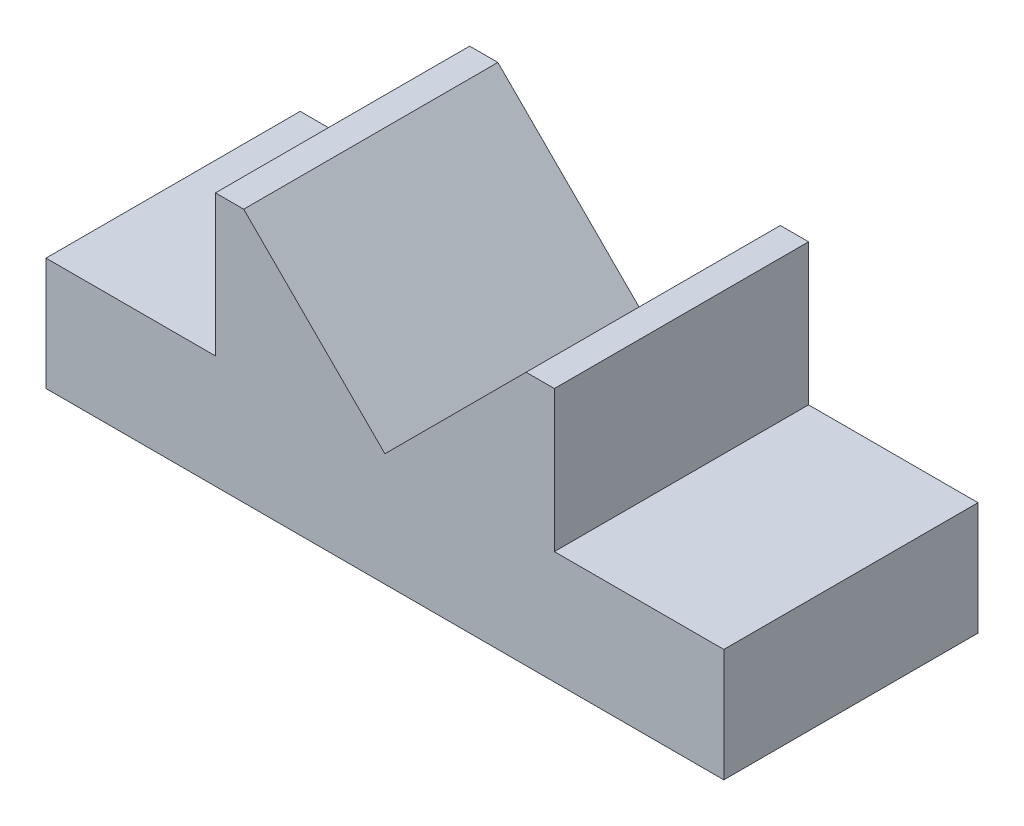
ISO-10303-21;
HEADER;
FILE_DESCRIPTION(('STEP AP214'),'2;1');
FILE_NAME('part.step','',(''),(''),'','','');
FILE_SCHEMA(('AUTOMOTIVE_DESIGN { 1 0 10303 214 1 1 1 1 }'));
ENDSEC;
DATA;
#1=APPLICATION_CONTEXT('core data for automotive mechanical design processes');
#2=APPLICATION_PROTOCOL_DEFINITION('international standard','automotive_design',2000,#1);
#3=PRODUCT_CONTEXT('',#1,'mechanical');
#4=PRODUCT('Part','Part','',(#3));
#5=PRODUCT_RELATED_PRODUCT_CATEGORY('part','',(#4));
#6=PRODUCT_DEFINITION_FORMATION('','',#4);
#7=PRODUCT_DEFINITION_CONTEXT('part definition',#1,'design');
#8=PRODUCT_DEFINITION('design','',#6,#7);
#9=PRODUCT_DEFINITION_SHAPE('','',#8);
#10=(LENGTH_UNIT() NAMED_UNIT(*) SI_UNIT(.MILLI.,.METRE.));
#11=(NAMED_UNIT(*) PLANE_ANGLE_UNIT() SI_UNIT($,.RADIAN.));
#12=(NAMED_UNIT(*) SI_UNIT($,.STERADIAN.) SOLID_ANGLE_UNIT());
#13=UNCERTAINTY_MEASURE_WITH_UNIT(LENGTH_MEASURE(1.E-05),#10,'distance_accuracy_value','');
#14=(GEOMETRIC_REPRESENTATION_CONTEXT(3) GLOBAL_UNCERTAINTY_ASSIGNED_CONTEXT((#13)) GLOBAL_UNIT_ASSIGNED_CONTEXT((#10,
#11,#12)) REPRESENTATION_CONTEXT('',''));
#15=CARTESIAN_POINT('',(0.,0.,0.));
#16=DIRECTION('',(0.,0.,1.));
#17=DIRECTION('',(1.,0.,0.));
#18=AXIS2_PLACEMENT_3D('',#15,#16,#17);
#19=CARTESIAN_POINT('',(-60.,0.,45.));
#20=DIRECTION('',(1.,0.,0.));
#21=DIRECTION('',(0.,0.,-1.));
#22=AXIS2_PLACEMENT_3D('',#19,#20,#21);
#23=PLANE('',#22);
#24=DIRECTION('',(0.,-1.,0.));
#25=VECTOR('',#24,1.);
#26=CARTESIAN_POINT('',(-60.,0.,0.));
#27=LINE('',#26,#25);
#28=CARTESIAN_POINT('',(-60.,20.,0.));
#29=VERTEX_POINT('',#28);
#30=CARTESIAN_POINT('',(-60.,0.,0.));
#31=VERTEX_POINT('',#30);
#32=EDGE_CURVE('E158',#29,#31,#27,.T.);
#33=ORIENTED_EDGE('',*,*,#32,.T.);
#34=DIRECTION('',(0.,0.,-1.));
#35=VECTOR('',#34,1.);
#36=CARTESIAN_POINT('',(-60.,0.,45.));
#37=LINE('',#36,#35);
#38=CARTESIAN_POINT('',(-60.,0.,45.));
#39=VERTEX_POINT('',#38);
#40=EDGE_CURVE('E11',#39,#31,#37,.T.);
#41=ORIENTED_EDGE('',*,*,#40,.F.);
#42=DIRECTION('',(0.,-1.,0.));
#43=VECTOR('',#42,1.);
#44=CARTESIAN_POINT('',(-60.,0.,45.));
#45=LINE('',#44,#43);
#46=CARTESIAN_POINT('',(-60.,20.,45.));
#47=VERTEX_POINT('',#46);
#48=EDGE_CURVE('E189',#47,#39,#45,.T.);
#49=ORIENTED_EDGE('',*,*,#48,.F.);
#50=DIRECTION('',(0.,0.,-1.));
#51=VECTOR('',#50,1.);
#52=CARTESIAN_POINT('',(-60.,20.,45.));
#53=LINE('',#52,#51);
#54=EDGE_CURVE('E154',#47,#29,#53,.T.);
#55=ORIENTED_EDGE('',*,*,#54,.T.);
#56=EDGE_LOOP('',(#33,#41,#49,#55));
#57=FACE_BOUND('',#56,.T.);
#58=ADVANCED_FACE('F39',(#57),#23,.F.);
#59=CARTESIAN_POINT('',(60.,0.,45.));
#60=DIRECTION('',(0.,1.,0.));
#61=DIRECTION('',(0.,0.,1.));
#62=AXIS2_PLACEMENT_3D('',#59,#60,#61);
#63=PLANE('',#62);
#64=DIRECTION('',(1.,0.,0.));
#65=VECTOR('',#64,1.);
#66=CARTESIAN_POINT('',(60.,0.,0.));
#67=LINE('',#66,#65);
#68=CARTESIAN_POINT('',(60.,0.,0.));
#69=VERTEX_POINT('',#68);
#70=EDGE_CURVE('E162',#31,#69,#67,.T.);
#71=ORIENTED_EDGE('',*,*,#70,.T.);
#72=DIRECTION('',(0.,0.,-1.));
#73=VECTOR('',#72,1.);
#74=CARTESIAN_POINT('',(60.,0.,45.));
#75=LINE('',#74,#73);
#76=CARTESIAN_POINT('',(60.,0.,45.));
#77=VERTEX_POINT('',#76);
#78=EDGE_CURVE('E48',#77,#69,#75,.T.);
#79=ORIENTED_EDGE('',*,*,#78,.F.);
#80=DIRECTION('',(1.,0.,0.));
#81=VECTOR('',#80,1.);
#82=CARTESIAN_POINT('',(60.,0.,45.));
#83=LINE('',#82,#81);
#84=EDGE_CURVE('E108',#39,#77,#83,.T.);
#85=ORIENTED_EDGE('',*,*,#84,.F.);
#86=ORIENTED_EDGE('',*,*,#40,.T.);
#87=EDGE_LOOP('',(#71,#79,#85,#86));
#88=FACE_BOUND('',#87,.T.);
#89=ADVANCED_FACE('F275',(#88),#63,.F.);
#90=CARTESIAN_POINT('',(60.,0.,45.));
#91=DIRECTION('',(-1.,0.,0.));
#92=DIRECTION('',(0.,-1.,0.));
#93=AXIS2_PLACEMENT_3D('',#90,#91,#92);
#94=PLANE('',#93);
#95=DIRECTION('',(0.,1.,0.));
#96=VECTOR('',#95,1.);
#97=CARTESIAN_POINT('',(60.,0.,0.));
#98=LINE('',#97,#96);
#99=CARTESIAN_POINT('',(59.9999999999998,20.,0.));
#100=VERTEX_POINT('',#99);
#101=EDGE_CURVE('E165',#69,#100,#98,.T.);
#102=ORIENTED_EDGE('',*,*,#101,.T.);
#103=DIRECTION('',(0.,0.,-1.));
#104=VECTOR('',#103,1.);
#105=CARTESIAN_POINT('',(59.9999999999998,20.,45.));
#106=LINE('',#105,#104);
#107=CARTESIAN_POINT('',(59.9999999999998,20.,45.));
#108=VERTEX_POINT('',#107);
#109=EDGE_CURVE('E212',#108,#100,#106,.T.);
#110=ORIENTED_EDGE('',*,*,#109,.F.);
#111=DIRECTION('',(0.,1.,0.));
#112=VECTOR('',#111,1.);
#113=CARTESIAN_POINT('',(60.,0.,45.));
#114=LINE('',#113,#112);
#115=EDGE_CURVE('E222',#77,#108,#114,.T.);
#116=ORIENTED_EDGE('',*,*,#115,.F.);
#117=ORIENTED_EDGE('',*,*,#78,.T.);
#118=EDGE_LOOP('',(#102,#110,#116,#117));
#119=FACE_BOUND('',#118,.T.);
#120=ADVANCED_FACE('F220',(#119),#94,.F.);
#121=CARTESIAN_POINT('',(59.9999999999998,20.,45.));
#122=DIRECTION('',(0.,-1.,0.));
#123=DIRECTION('',(1.,0.,0.));
#124=AXIS2_PLACEMENT_3D('',#121,#122,#123);
#125=PLANE('',#124);
#126=DIRECTION('',(-1.,0.,0.));
#127=VECTOR('',#126,1.);
#128=CARTESIAN_POINT('',(59.9999999999998,20.,0.));
#129=LINE('',#128,#127);
#130=CARTESIAN_POINT('',(30.,20.,0.));
#131=VERTEX_POINT('',#130);
#132=EDGE_CURVE('E168',#100,#131,#129,.T.);
#133=ORIENTED_EDGE('',*,*,#132,.T.);
#134=DIRECTION('',(0.,0.,-1.));
#135=VECTOR('',#134,1.);
#136=CARTESIAN_POINT('',(30.,20.,45.));
#137=LINE('',#136,#135);
#138=CARTESIAN_POINT('',(30.,20.,45.));
#139=VERTEX_POINT('',#138);
#140=EDGE_CURVE('E208',#139,#131,#137,.T.);
#141=ORIENTED_EDGE('',*,*,#140,.F.);
#142=DIRECTION('',(-1.,0.,0.));
#143=VECTOR('',#142,1.);
#144=CARTESIAN_POINT('',(59.9999999999998,20.,45.));
#145=LINE('',#144,#143);
#146=EDGE_CURVE('E241',#108,#139,#145,.T.);
#147=ORIENTED_EDGE('',*,*,#146,.F.);
#148=ORIENTED_EDGE('',*,*,#109,.T.);
#149=EDGE_LOOP('',(#133,#141,#147,#148));
#150=FACE_BOUND('',#149,.T.);
#151=ADVANCED_FACE('F231',(#150),#125,.F.);
#152=CARTESIAN_POINT('',(30.,20.,45.));
#153=DIRECTION('',(-1.,0.,0.));
#154=DIRECTION('',(0.,0.,1.));
#155=AXIS2_PLACEMENT_3D('',#152,#153,#154);
#156=PLANE('',#155);
#157=DIRECTION('',(0.,1.,0.));
#158=VECTOR('',#157,1.);
#159=CARTESIAN_POINT('',(30.,20.,0.));
#160=LINE('',#159,#158);
#161=CARTESIAN_POINT('',(30.,45.,0.));
#162=VERTEX_POINT('',#161);
#163=EDGE_CURVE('E171',#131,#162,#160,.T.);
#164=ORIENTED_EDGE('',*,*,#163,.T.);
#165=DIRECTION('',(0.,0.,-1.));
#166=VECTOR('',#165,1.);
#167=CARTESIAN_POINT('',(30.,45.,45.));
#168=LINE('',#167,#166);
#169=CARTESIAN_POINT('',(30.,45.,45.));
#170=VERTEX_POINT('',#169);
#171=EDGE_CURVE('E204',#170,#162,#168,.T.);
#172=ORIENTED_EDGE('',*,*,#171,.F.);
#173=DIRECTION('',(0.,1.,0.));
#174=VECTOR('',#173,1.);
#175=CARTESIAN_POINT('',(30.,20.,45.));
#176=LINE('',#175,#174);
#177=EDGE_CURVE('E237',#139,#170,#176,.T.);
#178=ORIENTED_EDGE('',*,*,#177,.F.);
#179=ORIENTED_EDGE('',*,*,#140,.T.);
#180=EDGE_LOOP('',(#164,#172,#178,#179));
#181=FACE_BOUND('',#180,.T.);
#182=ADVANCED_FACE('F235',(#181),#156,.F.);
#183=CARTESIAN_POINT('',(30.,45.,45.));
#184=DIRECTION('',(0.,-1.,0.));
#185=DIRECTION('',(0.,0.,-1.));
#186=AXIS2_PLACEMENT_3D('',#183,#184,#185);
#187=PLANE('',#186);
#188=DIRECTION('',(-1.,0.,0.));
#189=VECTOR('',#188,1.);
#190=CARTESIAN_POINT('',(30.,45.,0.));
#191=LINE('',#190,#189);
#192=CARTESIAN_POINT('',(25.,45.,0.));
#193=VERTEX_POINT('',#192);
#194=EDGE_CURVE('E174',#162,#193,#191,.T.);
#195=ORIENTED_EDGE('',*,*,#194,.T.);
#196=DIRECTION('',(0.,0.,-1.));
#197=VECTOR('',#196,1.);
#198=CARTESIAN_POINT('',(25.,45.,45.));
#199=LINE('',#198,#197);
#200=CARTESIAN_POINT('',(25.,45.,45.));
#201=VERTEX_POINT('',#200);
#202=EDGE_CURVE('E200',#201,#193,#199,.T.);
#203=ORIENTED_EDGE('',*,*,#202,.F.);
#204=DIRECTION('',(-1.,0.,0.));
#205=VECTOR('',#204,1.);
#206=CARTESIAN_POINT('',(30.,45.,45.));
#207=LINE('',#206,#205);
#208=EDGE_CURVE('E240',#170,#201,#207,.T.);
#209=ORIENTED_EDGE('',*,*,#208,.F.);
#210=ORIENTED_EDGE('',*,*,#171,.T.);
#211=EDGE_LOOP('',(#195,#203,#209,#210));
#212=FACE_BOUND('',#211,.T.);
#213=ADVANCED_FACE('F288',(#212),#187,.F.);
#214=CARTESIAN_POINT('',(25.,45.,45.));
#215=DIRECTION('',(0.707106781186553,-0.707106781186542,0.));
#216=DIRECTION('',(0.707106781186542,0.707106781186553,0.));
#217=AXIS2_PLACEMENT_3D('',#214,#215,#216);
#218=PLANE('',#217);
#219=DIRECTION('',(-0.707106781186542,-0.707106781186553,0.));
#220=VECTOR('',#219,1.);
#221=CARTESIAN_POINT('',(25.,45.,0.));
#222=LINE('',#221,#220);
#223=CARTESIAN_POINT('',(0.,19.9999999999996,0.));
#224=VERTEX_POINT('',#223);
#225=EDGE_CURVE('E177',#193,#224,#222,.T.);
#226=ORIENTED_EDGE('',*,*,#225,.T.);
#227=DIRECTION('',(0.,0.,-1.));
#228=VECTOR('',#227,1.);
#229=CARTESIAN_POINT('',(0.,19.9999999999996,45.));
#230=LINE('',#229,#228);
#231=CARTESIAN_POINT('',(0.,19.9999999999996,45.));
#232=VERTEX_POINT('',#231);
#233=EDGE_CURVE('E196',#232,#224,#230,.T.);
#234=ORIENTED_EDGE('',*,*,#233,.F.);
#235=DIRECTION('',(-0.707106781186542,-0.707106781186553,0.));
#236=VECTOR('',#235,1.);
#237=CARTESIAN_POINT('',(25.,45.,45.));
#238=LINE('',#237,#236);
#239=EDGE_CURVE('E245',#201,#232,#238,.T.);
#240=ORIENTED_EDGE('',*,*,#239,.F.);
#241=ORIENTED_EDGE('',*,*,#202,.T.);
#242=EDGE_LOOP('',(#226,#234,#240,#241));
#243=FACE_BOUND('',#242,.T.);
#244=ADVANCED_FACE('F256',(#243),#218,.F.);
#245=CARTESIAN_POINT('',(-25.,45.,45.));
#246=DIRECTION('',(-0.707106781186553,-0.707106781186542,0.));
#247=DIRECTION('',(0.707106781186542,-0.707106781186553,0.));
#248=AXIS2_PLACEMENT_3D('',#245,#246,#247);
#249=PLANE('',#248);
#250=DIRECTION('',(-0.707106781186542,0.707106781186553,0.));
#251=VECTOR('',#250,1.);
#252=CARTESIAN_POINT('',(-25.,45.,0.));
#253=LINE('',#252,#251);
#254=CARTESIAN_POINT('',(-25.,45.,0.));
#255=VERTEX_POINT('',#254);
#256=EDGE_CURVE('E180',#224,#255,#253,.T.);
#257=ORIENTED_EDGE('',*,*,#256,.T.);
#258=DIRECTION('',(0.,0.,-1.));
#259=VECTOR('',#258,1.);
#260=CARTESIAN_POINT('',(-25.,45.,45.));
#261=LINE('',#260,#259);
#262=CARTESIAN_POINT('',(-25.,45.,45.));
#263=VERTEX_POINT('',#262);
#264=EDGE_CURVE('E147',#263,#255,#261,.T.);
#265=ORIENTED_EDGE('',*,*,#264,.F.);
#266=DIRECTION('',(-0.707106781186542,0.707106781186553,0.));
#267=VECTOR('',#266,1.);
#268=CARTESIAN_POINT('',(-25.,45.,45.));
#269=LINE('',#268,#267);
#270=EDGE_CURVE('E136',#232,#263,#269,.T.);
#271=ORIENTED_EDGE('',*,*,#270,.F.);
#272=ORIENTED_EDGE('',*,*,#233,.T.);
#273=EDGE_LOOP('',(#257,#265,#271,#272));
#274=FACE_BOUND('',#273,.T.);
#275=ADVANCED_FACE('F260',(#274),#249,.F.);
#276=CARTESIAN_POINT('',(-30.,45.,45.));
#277=DIRECTION('',(0.,-1.,0.));
#278=DIRECTION('',(0.,0.,-1.));
#279=AXIS2_PLACEMENT_3D('',#276,#277,#278);
#280=PLANE('',#279);
#281=DIRECTION('',(-1.,0.,0.));
#282=VECTOR('',#281,1.);
#283=CARTESIAN_POINT('',(-30.,45.,0.));
#284=LINE('',#283,#282);
#285=CARTESIAN_POINT('',(-30.,45.,0.));
#286=VERTEX_POINT('',#285);
#287=EDGE_CURVE('E145',#255,#286,#284,.T.);
#288=ORIENTED_EDGE('',*,*,#287,.T.);
#289=DIRECTION('',(0.,0.,-1.));
#290=VECTOR('',#289,1.);
#291=CARTESIAN_POINT('',(-30.,45.,45.));
#292=LINE('',#291,#290);
#293=CARTESIAN_POINT('',(-30.,45.,45.));
#294=VERTEX_POINT('',#293);
#295=EDGE_CURVE('E142',#294,#286,#292,.T.);
#296=ORIENTED_EDGE('',*,*,#295,.F.);
#297=DIRECTION('',(-1.,0.,0.));
#298=VECTOR('',#297,1.);
#299=CARTESIAN_POINT('',(-30.,45.,45.));
#300=LINE('',#299,#298);
#301=EDGE_CURVE('E130',#263,#294,#300,.T.);
#302=ORIENTED_EDGE('',*,*,#301,.F.);
#303=ORIENTED_EDGE('',*,*,#264,.T.);
#304=EDGE_LOOP('',(#288,#296,#302,#303));
#305=FACE_BOUND('',#304,.T.);
#306=ADVANCED_FACE('F143',(#305),#280,.F.);
#307=CARTESIAN_POINT('',(-30.,20.,45.));
#308=DIRECTION('',(1.,0.,0.));
#309=DIRECTION('',(0.,0.,-1.));
#310=AXIS2_PLACEMENT_3D('',#307,#308,#309);
#311=PLANE('',#310);
#312=DIRECTION('',(0.,-1.,0.));
#313=VECTOR('',#312,1.);
#314=CARTESIAN_POINT('',(-30.,20.,0.));
#315=LINE('',#314,#313);
#316=CARTESIAN_POINT('',(-30.,20.,0.));
#317=VERTEX_POINT('',#316);
#318=EDGE_CURVE('E94',#286,#317,#315,.T.);
#319=ORIENTED_EDGE('',*,*,#318,.T.);
#320=DIRECTION('',(0.,0.,-1.));
#321=VECTOR('',#320,1.);
#322=CARTESIAN_POINT('',(-30.,20.,45.));
#323=LINE('',#322,#321);
#324=CARTESIAN_POINT('',(-30.,20.,45.));
#325=VERTEX_POINT('',#324);
#326=EDGE_CURVE('E148',#325,#317,#323,.T.);
#327=ORIENTED_EDGE('',*,*,#326,.F.);
#328=DIRECTION('',(0.,-1.,0.));
#329=VECTOR('',#328,1.);
#330=CARTESIAN_POINT('',(-30.,20.,45.));
#331=LINE('',#330,#329);
#332=EDGE_CURVE('E134',#294,#325,#331,.T.);
#333=ORIENTED_EDGE('',*,*,#332,.F.);
#334=ORIENTED_EDGE('',*,*,#295,.T.);
#335=EDGE_LOOP('',(#319,#327,#333,#334));
#336=FACE_BOUND('',#335,.T.);
#337=ADVANCED_FACE('F150',(#336),#311,.F.);
#338=CARTESIAN_POINT('',(-60.,20.,45.));
#339=DIRECTION('',(0.,-1.,0.));
#340=DIRECTION('',(1.,0.,0.));
#341=AXIS2_PLACEMENT_3D('',#338,#339,#340);
#342=PLANE('',#341);
#343=DIRECTION('',(-1.,0.,0.));
#344=VECTOR('',#343,1.);
#345=CARTESIAN_POINT('',(-60.,20.,0.));
#346=LINE('',#345,#344);
#347=EDGE_CURVE('E100',#317,#29,#346,.T.);
#348=ORIENTED_EDGE('',*,*,#347,.T.);
#349=ORIENTED_EDGE('',*,*,#54,.F.);
#350=DIRECTION('',(-1.,0.,0.));
#351=VECTOR('',#350,1.);
#352=CARTESIAN_POINT('',(-60.,20.,45.));
#353=LINE('',#352,#351);
#354=EDGE_CURVE('E56',#325,#47,#353,.T.);
#355=ORIENTED_EDGE('',*,*,#354,.F.);
#356=ORIENTED_EDGE('',*,*,#326,.T.);
#357=EDGE_LOOP('',(#348,#349,#355,#356));
#358=FACE_BOUND('',#357,.T.);
#359=ADVANCED_FACE('F264',(#358),#342,.F.);
#360=CARTESIAN_POINT('',(0.,0.,45.));
#361=DIRECTION('',(0.,0.,-1.));
#362=DIRECTION('',(-1.,0.,0.));
#363=AXIS2_PLACEMENT_3D('',#360,#361,#362);
#364=PLANE('',#363);
#365=ORIENTED_EDGE('',*,*,#48,.T.);
#366=ORIENTED_EDGE('',*,*,#84,.T.);
#367=ORIENTED_EDGE('',*,*,#115,.T.);
#368=ORIENTED_EDGE('',*,*,#146,.T.);
#369=ORIENTED_EDGE('',*,*,#177,.T.);
#370=ORIENTED_EDGE('',*,*,#208,.T.);
#371=ORIENTED_EDGE('',*,*,#239,.T.);
#372=ORIENTED_EDGE('',*,*,#270,.T.);
#373=ORIENTED_EDGE('',*,*,#301,.T.);
#374=ORIENTED_EDGE('',*,*,#332,.T.);
#375=ORIENTED_EDGE('',*,*,#354,.T.);
#376=EDGE_LOOP('',(#365,#366,#367,#368,#369,#370,#371,#372,#373,#374,#375));
#377=FACE_BOUND('',#376,.T.);
#378=ADVANCED_FACE('F132',(#377),#364,.F.);
#379=CARTESIAN_POINT('',(0.,0.,0.));
#380=DIRECTION('',(0.,0.,-1.));
#381=DIRECTION('',(-1.,0.,0.));
#382=AXIS2_PLACEMENT_3D('',#379,#380,#381);
#383=PLANE('',#382);
#384=ORIENTED_EDGE('',*,*,#32,.F.);
#385=ORIENTED_EDGE('',*,*,#347,.F.);
#386=ORIENTED_EDGE('',*,*,#318,.F.);
#387=ORIENTED_EDGE('',*,*,#287,.F.);
#388=ORIENTED_EDGE('',*,*,#256,.F.);
#389=ORIENTED_EDGE('',*,*,#225,.F.);
#390=ORIENTED_EDGE('',*,*,#194,.F.);
#391=ORIENTED_EDGE('',*,*,#163,.F.);
#392=ORIENTED_EDGE('',*,*,#132,.F.);
#393=ORIENTED_EDGE('',*,*,#101,.F.);
#394=ORIENTED_EDGE('',*,*,#70,.F.);
#395=EDGE_LOOP('',(#384,#385,#386,#387,#388,#389,#390,#391,#392,#393,#394));
#396=FACE_BOUND('',#395,.T.);
#397=ADVANCED_FACE('F226',(#396),#383,.T.);
#398=CLOSED_SHELL('',(#58,#89,#120,#151,#182,#213,#244,#275,#306,#337,#359,#378,#397));
#399=MANIFOLD_SOLID_BREP('B2',#398);
#400=ADVANCED_BREP_SHAPE_REPRESENTATION('',(#18,#399),#14);
#401=SHAPE_DEFINITION_REPRESENTATION(#9,#400);
ENDSEC;
END-ISO-10303-21;
